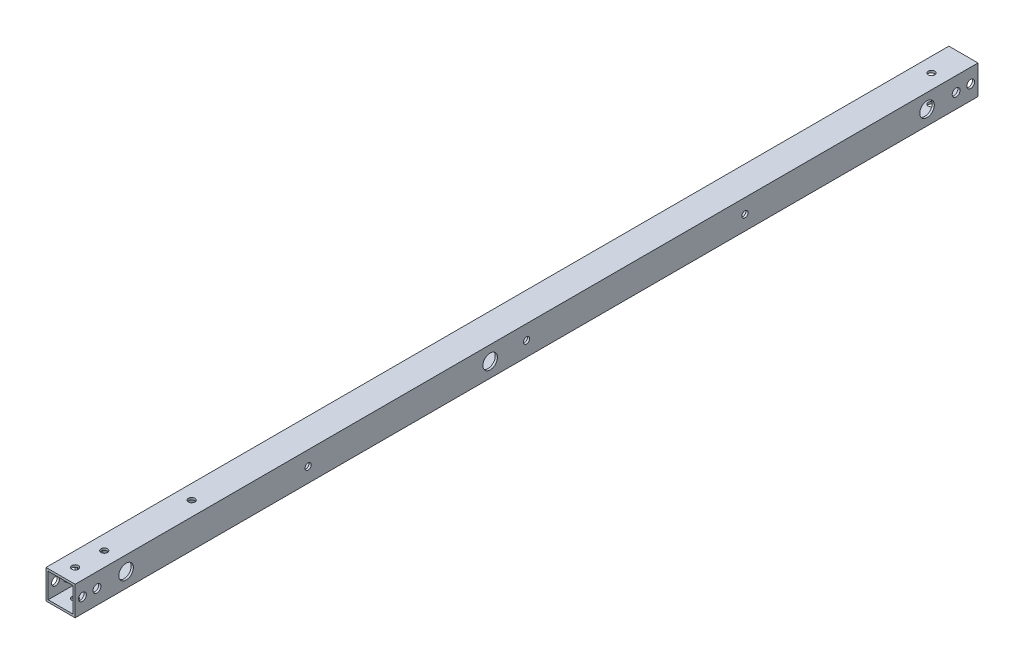
ISO-10303-21;
HEADER;
FILE_DESCRIPTION(('STEP AP214'),'2;1');
FILE_NAME('part.step','',(''),(''),'','','');
FILE_SCHEMA(('AUTOMOTIVE_DESIGN { 1 0 10303 214 1 1 1 1 }'));
ENDSEC;
DATA;
#1=APPLICATION_CONTEXT('core data for automotive mechanical design processes');
#2=APPLICATION_PROTOCOL_DEFINITION('international standard','automotive_design',2000,#1);
#3=PRODUCT_CONTEXT('',#1,'mechanical');
#4=PRODUCT('Part','Part','',(#3));
#5=PRODUCT_RELATED_PRODUCT_CATEGORY('part','',(#4));
#6=PRODUCT_DEFINITION_FORMATION('','',#4);
#7=PRODUCT_DEFINITION_CONTEXT('part definition',#1,'design');
#8=PRODUCT_DEFINITION('design','',#6,#7);
#9=PRODUCT_DEFINITION_SHAPE('','',#8);
#10=(LENGTH_UNIT() NAMED_UNIT(*) SI_UNIT(.MILLI.,.METRE.));
#11=(NAMED_UNIT(*) PLANE_ANGLE_UNIT() SI_UNIT($,.RADIAN.));
#12=(NAMED_UNIT(*) SI_UNIT($,.STERADIAN.) SOLID_ANGLE_UNIT());
#13=UNCERTAINTY_MEASURE_WITH_UNIT(LENGTH_MEASURE(1.E-05),#10,'distance_accuracy_value','');
#14=(GEOMETRIC_REPRESENTATION_CONTEXT(3) GLOBAL_UNCERTAINTY_ASSIGNED_CONTEXT((#13)) GLOBAL_UNIT_ASSIGNED_CONTEXT((#10,
#11,#12)) REPRESENTATION_CONTEXT('',''));
#15=CARTESIAN_POINT('',(0.,0.,0.));
#16=DIRECTION('',(0.,0.,1.));
#17=DIRECTION('',(1.,0.,0.));
#18=AXIS2_PLACEMENT_3D('',#15,#16,#17);
#19=CARTESIAN_POINT('',(-8.5,-8.5,620.));
#20=DIRECTION('',(1.,0.,0.));
#21=DIRECTION('',(0.,0.,-1.));
#22=AXIS2_PLACEMENT_3D('',#19,#20,#21);
#23=PLANE('',#22);
#24=CARTESIAN_POINT('',(-8.5,0.,160.));
#25=DIRECTION('',(-1.,0.,0.));
#26=DIRECTION('',(0.,0.,1.));
#27=AXIS2_PLACEMENT_3D('',#24,#25,#26);
#28=CIRCLE('',#27,5.);
#29=CARTESIAN_POINT('',(-8.5,0.,165.));
#30=VERTEX_POINT('',#29);
#31=EDGE_CURVE('E739',#30,#30,#28,.T.);
#32=ORIENTED_EDGE('',*,*,#31,.T.);
#33=EDGE_LOOP('',(#32));
#34=FACE_BOUND('',#33,.T.);
#35=CARTESIAN_POINT('',(-8.5,0.,310.));
#36=DIRECTION('',(-1.,0.,0.));
#37=DIRECTION('',(0.,0.,1.));
#38=AXIS2_PLACEMENT_3D('',#35,#36,#37);
#39=CIRCLE('',#38,5.);
#40=CARTESIAN_POINT('',(-8.5,0.,315.));
#41=VERTEX_POINT('',#40);
#42=EDGE_CURVE('E753',#41,#41,#39,.T.);
#43=ORIENTED_EDGE('',*,*,#42,.T.);
#44=EDGE_LOOP('',(#43));
#45=FACE_BOUND('',#44,.T.);
#46=DIRECTION('',(0.,-1.,0.));
#47=VECTOR('',#46,1.);
#48=CARTESIAN_POINT('',(-8.5,-8.5,0.));
#49=LINE('',#48,#47);
#50=CARTESIAN_POINT('',(-8.5,8.5,0.));
#51=VERTEX_POINT('',#50);
#52=CARTESIAN_POINT('',(-8.5,-8.5,0.));
#53=VERTEX_POINT('',#52);
#54=EDGE_CURVE('E160',#51,#53,#49,.T.);
#55=ORIENTED_EDGE('',*,*,#54,.F.);
#56=DIRECTION('',(0.,0.,-1.));
#57=VECTOR('',#56,1.);
#58=CARTESIAN_POINT('',(-8.5,8.5,620.));
#59=LINE('',#58,#57);
#60=CARTESIAN_POINT('',(-8.5,8.5,620.));
#61=VERTEX_POINT('',#60);
#62=EDGE_CURVE('E140',#61,#51,#59,.T.);
#63=ORIENTED_EDGE('',*,*,#62,.F.);
#64=DIRECTION('',(0.,-1.,0.));
#65=VECTOR('',#64,1.);
#66=CARTESIAN_POINT('',(-8.5,-8.5,620.));
#67=LINE('',#66,#65);
#68=CARTESIAN_POINT('',(-8.5,-8.5,620.));
#69=VERTEX_POINT('',#68);
#70=EDGE_CURVE('E144',#61,#69,#67,.T.);
#71=ORIENTED_EDGE('',*,*,#70,.T.);
#72=DIRECTION('',(0.,0.,-1.));
#73=VECTOR('',#72,1.);
#74=CARTESIAN_POINT('',(-8.5,-8.5,620.));
#75=LINE('',#74,#73);
#76=EDGE_CURVE('E71',#69,#53,#75,.T.);
#77=ORIENTED_EDGE('',*,*,#76,.T.);
#78=EDGE_LOOP('',(#55,#63,#71,#77));
#79=FACE_BOUND('',#78,.T.);
#80=CARTESIAN_POINT('',(-8.5,0.,335.));
#81=DIRECTION('',(1.,0.,0.));
#82=DIRECTION('',(0.,0.,-1.));
#83=AXIS2_PLACEMENT_3D('',#80,#81,#82);
#84=CIRCLE('',#83,2.69999999999996);
#85=CARTESIAN_POINT('',(-8.5,0.,332.3));
#86=VERTEX_POINT('',#85);
#87=EDGE_CURVE('E209',#86,#86,#84,.T.);
#88=ORIENTED_EDGE('',*,*,#87,.F.);
#89=EDGE_LOOP('',(#88));
#90=FACE_BOUND('',#89,.T.);
#91=CARTESIAN_POINT('',(-8.5,0.,34.9999999999999));
#92=DIRECTION('',(1.,0.,0.));
#93=DIRECTION('',(0.,0.,-1.));
#94=AXIS2_PLACEMENT_3D('',#91,#92,#93);
#95=CIRCLE('',#94,2.7);
#96=CARTESIAN_POINT('',(-8.5,0.,32.2999999999999));
#97=VERTEX_POINT('',#96);
#98=EDGE_CURVE('E215',#97,#97,#95,.T.);
#99=ORIENTED_EDGE('',*,*,#98,.F.);
#100=EDGE_LOOP('',(#99));
#101=FACE_BOUND('',#100,.T.);
#102=CARTESIAN_POINT('',(-8.5,0.,585.));
#103=DIRECTION('',(1.,0.,0.));
#104=DIRECTION('',(0.,0.,-1.));
#105=AXIS2_PLACEMENT_3D('',#102,#103,#104);
#106=CIRCLE('',#105,2.70000000000001);
#107=CARTESIAN_POINT('',(-8.5,0.,582.3));
#108=VERTEX_POINT('',#107);
#109=EDGE_CURVE('E220',#108,#108,#106,.T.);
#110=ORIENTED_EDGE('',*,*,#109,.F.);
#111=EDGE_LOOP('',(#110));
#112=FACE_BOUND('',#111,.T.);
#113=CARTESIAN_POINT('',(-8.5,0.,615.));
#114=DIRECTION('',(1.,0.,0.));
#115=DIRECTION('',(0.,0.,-1.));
#116=AXIS2_PLACEMENT_3D('',#113,#114,#115);
#117=CIRCLE('',#116,2.70000000000001);
#118=CARTESIAN_POINT('',(-8.5,0.,612.3));
#119=VERTEX_POINT('',#118);
#120=EDGE_CURVE('E242',#119,#119,#117,.T.);
#121=ORIENTED_EDGE('',*,*,#120,.F.);
#122=EDGE_LOOP('',(#121));
#123=FACE_BOUND('',#122,.T.);
#124=CARTESIAN_POINT('',(-8.5,0.,5.));
#125=DIRECTION('',(1.,0.,0.));
#126=DIRECTION('',(0.,0.,-1.));
#127=AXIS2_PLACEMENT_3D('',#124,#125,#126);
#128=CIRCLE('',#127,2.7);
#129=CARTESIAN_POINT('',(-8.5,0.,2.3));
#130=VERTEX_POINT('',#129);
#131=EDGE_CURVE('E248',#130,#130,#128,.T.);
#132=ORIENTED_EDGE('',*,*,#131,.F.);
#133=EDGE_LOOP('',(#132));
#134=FACE_BOUND('',#133,.T.);
#135=CARTESIAN_POINT('',(-8.5,0.,605.));
#136=DIRECTION('',(1.,0.,0.));
#137=DIRECTION('',(0.,0.,-1.));
#138=AXIS2_PLACEMENT_3D('',#135,#136,#137);
#139=CIRCLE('',#138,5.00000000000004);
#140=CARTESIAN_POINT('',(-8.5,0.,600.));
#141=VERTEX_POINT('',#140);
#142=EDGE_CURVE('E276',#141,#141,#139,.T.);
#143=ORIENTED_EDGE('',*,*,#142,.F.);
#144=EDGE_LOOP('',(#143));
#145=FACE_BOUND('',#144,.T.);
#146=CARTESIAN_POINT('',(-8.5,0.,15.));
#147=DIRECTION('',(1.,0.,0.));
#148=DIRECTION('',(0.,0.,-1.));
#149=AXIS2_PLACEMENT_3D('',#146,#147,#148);
#150=CIRCLE('',#149,5.);
#151=CARTESIAN_POINT('',(-8.5,0.,10.));
#152=VERTEX_POINT('',#151);
#153=EDGE_CURVE('E280',#152,#152,#150,.T.);
#154=ORIENTED_EDGE('',*,*,#153,.F.);
#155=EDGE_LOOP('',(#154));
#156=FACE_BOUND('',#155,.T.);
#157=CARTESIAN_POINT('',(-8.5,0.,460.));
#158=DIRECTION('',(-1.,0.,0.));
#159=DIRECTION('',(0.,0.,1.));
#160=AXIS2_PLACEMENT_3D('',#157,#158,#159);
#161=CIRCLE('',#160,5.);
#162=CARTESIAN_POINT('',(-8.5,0.,465.));
#163=VERTEX_POINT('',#162);
#164=EDGE_CURVE('E761',#163,#163,#161,.T.);
#165=ORIENTED_EDGE('',*,*,#164,.T.);
#166=EDGE_LOOP('',(#165));
#167=FACE_BOUND('',#166,.T.);
#168=ADVANCED_FACE('F53',(#34,#45,#79,#90,#101,#112,#123,#134,#145,#156,#167),#23,.T.);
#169=CARTESIAN_POINT('',(0.,0.,620.));
#170=DIRECTION('',(0.,0.,-1.));
#171=DIRECTION('',(-1.,0.,0.));
#172=AXIS2_PLACEMENT_3D('',#169,#170,#171);
#173=PLANE('',#172);
#174=DIRECTION('',(0.,1.,0.));
#175=VECTOR('',#174,1.);
#176=CARTESIAN_POINT('',(10.,-10.,620.));
#177=LINE('',#176,#175);
#178=CARTESIAN_POINT('',(10.,-10.,620.));
#179=VERTEX_POINT('',#178);
#180=CARTESIAN_POINT('',(10.,10.,620.));
#181=VERTEX_POINT('',#180);
#182=EDGE_CURVE('E173',#179,#181,#177,.T.);
#183=ORIENTED_EDGE('',*,*,#182,.T.);
#184=DIRECTION('',(-1.,0.,0.));
#185=VECTOR('',#184,1.);
#186=CARTESIAN_POINT('',(-10.,10.,620.));
#187=LINE('',#186,#185);
#188=CARTESIAN_POINT('',(-10.,10.,620.));
#189=VERTEX_POINT('',#188);
#190=EDGE_CURVE('E177',#181,#189,#187,.T.);
#191=ORIENTED_EDGE('',*,*,#190,.T.);
#192=DIRECTION('',(0.,-1.,0.));
#193=VECTOR('',#192,1.);
#194=CARTESIAN_POINT('',(-10.,-10.,620.));
#195=LINE('',#194,#193);
#196=CARTESIAN_POINT('',(-10.,-10.,620.));
#197=VERTEX_POINT('',#196);
#198=EDGE_CURVE('E181',#189,#197,#195,.T.);
#199=ORIENTED_EDGE('',*,*,#198,.T.);
#200=DIRECTION('',(1.,0.,0.));
#201=VECTOR('',#200,1.);
#202=CARTESIAN_POINT('',(-10.,-10.,620.));
#203=LINE('',#202,#201);
#204=EDGE_CURVE('E184',#197,#179,#203,.T.);
#205=ORIENTED_EDGE('',*,*,#204,.T.);
#206=EDGE_LOOP('',(#183,#191,#199,#205));
#207=FACE_BOUND('',#206,.T.);
#208=DIRECTION('',(0.,1.,0.));
#209=VECTOR('',#208,1.);
#210=CARTESIAN_POINT('',(8.5,-8.5,620.));
#211=LINE('',#210,#209);
#212=CARTESIAN_POINT('',(8.5,-8.5,620.));
#213=VERTEX_POINT('',#212);
#214=CARTESIAN_POINT('',(8.5,8.5,620.));
#215=VERTEX_POINT('',#214);
#216=EDGE_CURVE('E121',#213,#215,#211,.T.);
#217=ORIENTED_EDGE('',*,*,#216,.F.);
#218=DIRECTION('',(1.,0.,0.));
#219=VECTOR('',#218,1.);
#220=CARTESIAN_POINT('',(-8.5,-8.5,620.));
#221=LINE('',#220,#219);
#222=EDGE_CURVE('E149',#69,#213,#221,.T.);
#223=ORIENTED_EDGE('',*,*,#222,.F.);
#224=ORIENTED_EDGE('',*,*,#70,.F.);
#225=DIRECTION('',(-1.,0.,0.));
#226=VECTOR('',#225,1.);
#227=CARTESIAN_POINT('',(-8.5,8.5,620.));
#228=LINE('',#227,#226);
#229=EDGE_CURVE('E130',#215,#61,#228,.T.);
#230=ORIENTED_EDGE('',*,*,#229,.F.);
#231=EDGE_LOOP('',(#217,#223,#224,#230));
#232=FACE_BOUND('',#231,.T.);
#233=ADVANCED_FACE('F143',(#207,#232),#173,.F.);
#234=CARTESIAN_POINT('',(0.,0.,0.));
#235=DIRECTION('',(0.,0.,-1.));
#236=DIRECTION('',(-1.,0.,0.));
#237=AXIS2_PLACEMENT_3D('',#234,#235,#236);
#238=PLANE('',#237);
#239=DIRECTION('',(0.,1.,0.));
#240=VECTOR('',#239,1.);
#241=CARTESIAN_POINT('',(10.,-10.,0.));
#242=LINE('',#241,#240);
#243=CARTESIAN_POINT('',(10.,-10.,0.));
#244=VERTEX_POINT('',#243);
#245=CARTESIAN_POINT('',(10.,10.,0.));
#246=VERTEX_POINT('',#245);
#247=EDGE_CURVE('E139',#244,#246,#242,.T.);
#248=ORIENTED_EDGE('',*,*,#247,.F.);
#249=DIRECTION('',(1.,0.,0.));
#250=VECTOR('',#249,1.);
#251=CARTESIAN_POINT('',(-10.,-10.,0.));
#252=LINE('',#251,#250);
#253=CARTESIAN_POINT('',(-10.,-10.,0.));
#254=VERTEX_POINT('',#253);
#255=EDGE_CURVE('E178',#254,#244,#252,.T.);
#256=ORIENTED_EDGE('',*,*,#255,.F.);
#257=DIRECTION('',(0.,-1.,0.));
#258=VECTOR('',#257,1.);
#259=CARTESIAN_POINT('',(-10.,-10.,0.));
#260=LINE('',#259,#258);
#261=CARTESIAN_POINT('',(-10.,10.,0.));
#262=VERTEX_POINT('',#261);
#263=EDGE_CURVE('E194',#262,#254,#260,.T.);
#264=ORIENTED_EDGE('',*,*,#263,.F.);
#265=DIRECTION('',(-1.,0.,0.));
#266=VECTOR('',#265,1.);
#267=CARTESIAN_POINT('',(-10.,10.,0.));
#268=LINE('',#267,#266);
#269=EDGE_CURVE('E191',#246,#262,#268,.T.);
#270=ORIENTED_EDGE('',*,*,#269,.F.);
#271=EDGE_LOOP('',(#248,#256,#264,#270));
#272=FACE_BOUND('',#271,.T.);
#273=DIRECTION('',(1.,0.,0.));
#274=VECTOR('',#273,1.);
#275=CARTESIAN_POINT('',(-8.5,-8.5,0.));
#276=LINE('',#275,#274);
#277=CARTESIAN_POINT('',(8.5,-8.5,0.));
#278=VERTEX_POINT('',#277);
#279=EDGE_CURVE('E131',#53,#278,#276,.T.);
#280=ORIENTED_EDGE('',*,*,#279,.T.);
#281=DIRECTION('',(0.,1.,0.));
#282=VECTOR('',#281,1.);
#283=CARTESIAN_POINT('',(8.5,-8.5,0.));
#284=LINE('',#283,#282);
#285=CARTESIAN_POINT('',(8.5,8.5,0.));
#286=VERTEX_POINT('',#285);
#287=EDGE_CURVE('E79',#278,#286,#284,.T.);
#288=ORIENTED_EDGE('',*,*,#287,.T.);
#289=DIRECTION('',(-1.,0.,0.));
#290=VECTOR('',#289,1.);
#291=CARTESIAN_POINT('',(-8.5,8.5,0.));
#292=LINE('',#291,#290);
#293=EDGE_CURVE('E137',#286,#51,#292,.T.);
#294=ORIENTED_EDGE('',*,*,#293,.T.);
#295=ORIENTED_EDGE('',*,*,#54,.T.);
#296=EDGE_LOOP('',(#280,#288,#294,#295));
#297=FACE_BOUND('',#296,.T.);
#298=ADVANCED_FACE('F433',(#272,#297),#238,.T.);
#299=CARTESIAN_POINT('',(10.,-10.,620.));
#300=DIRECTION('',(-1.,0.,0.));
#301=DIRECTION('',(0.,0.,1.));
#302=AXIS2_PLACEMENT_3D('',#299,#300,#301);
#303=PLANE('',#302);
#304=CARTESIAN_POINT('',(10.,0.,460.));
#305=DIRECTION('',(1.,0.,0.));
#306=DIRECTION('',(0.,0.,-1.));
#307=AXIS2_PLACEMENT_3D('',#304,#305,#306);
#308=CIRCLE('',#307,2.14999999999999);
#309=CARTESIAN_POINT('',(10.,0.,457.85));
#310=VERTEX_POINT('',#309);
#311=EDGE_CURVE('E765',#310,#310,#308,.T.);
#312=ORIENTED_EDGE('',*,*,#311,.F.);
#313=EDGE_LOOP('',(#312));
#314=FACE_BOUND('',#313,.T.);
#315=CARTESIAN_POINT('',(10.,0.,310.));
#316=DIRECTION('',(1.,0.,0.));
#317=DIRECTION('',(0.,0.,-1.));
#318=AXIS2_PLACEMENT_3D('',#315,#316,#317);
#319=CIRCLE('',#318,2.14999999999999);
#320=CARTESIAN_POINT('',(10.,0.,307.85));
#321=VERTEX_POINT('',#320);
#322=EDGE_CURVE('E302',#321,#321,#319,.T.);
#323=ORIENTED_EDGE('',*,*,#322,.F.);
#324=EDGE_LOOP('',(#323));
#325=FACE_BOUND('',#324,.T.);
#326=CARTESIAN_POINT('',(10.,0.,160.));
#327=DIRECTION('',(1.,0.,0.));
#328=DIRECTION('',(0.,0.,-1.));
#329=AXIS2_PLACEMENT_3D('',#326,#327,#328);
#330=CIRCLE('',#329,2.14999999999999);
#331=CARTESIAN_POINT('',(10.,0.,157.85));
#332=VERTEX_POINT('',#331);
#333=EDGE_CURVE('E287',#332,#332,#330,.T.);
#334=ORIENTED_EDGE('',*,*,#333,.F.);
#335=EDGE_LOOP('',(#334));
#336=FACE_BOUND('',#335,.T.);
#337=CARTESIAN_POINT('',(10.,0.,585.));
#338=DIRECTION('',(-1.,0.,0.));
#339=DIRECTION('',(0.,0.,1.));
#340=AXIS2_PLACEMENT_3D('',#337,#338,#339);
#341=CIRCLE('',#340,5.00000000000004);
#342=CARTESIAN_POINT('',(10.,0.,590.));
#343=VERTEX_POINT('',#342);
#344=EDGE_CURVE('E275',#343,#343,#341,.F.);
#345=ORIENTED_EDGE('',*,*,#344,.F.);
#346=EDGE_LOOP('',(#345));
#347=FACE_BOUND('',#346,.T.);
#348=CARTESIAN_POINT('',(10.,0.,335.));
#349=DIRECTION('',(-1.,0.,0.));
#350=DIRECTION('',(0.,0.,1.));
#351=AXIS2_PLACEMENT_3D('',#348,#349,#350);
#352=CIRCLE('',#351,4.99999999999999);
#353=CARTESIAN_POINT('',(10.,0.,340.));
#354=VERTEX_POINT('',#353);
#355=EDGE_CURVE('E270',#354,#354,#352,.F.);
#356=ORIENTED_EDGE('',*,*,#355,.F.);
#357=EDGE_LOOP('',(#356));
#358=FACE_BOUND('',#357,.T.);
#359=CARTESIAN_POINT('',(10.,0.,34.9999999999999));
#360=DIRECTION('',(-1.,0.,0.));
#361=DIRECTION('',(0.,0.,1.));
#362=AXIS2_PLACEMENT_3D('',#359,#360,#361);
#363=CIRCLE('',#362,5.);
#364=CARTESIAN_POINT('',(10.,0.,39.9999999999999));
#365=VERTEX_POINT('',#364);
#366=EDGE_CURVE('E264',#365,#365,#363,.F.);
#367=ORIENTED_EDGE('',*,*,#366,.F.);
#368=EDGE_LOOP('',(#367));
#369=FACE_BOUND('',#368,.T.);
#370=CARTESIAN_POINT('',(10.,0.,5.));
#371=DIRECTION('',(1.,0.,0.));
#372=DIRECTION('',(0.,0.,-1.));
#373=AXIS2_PLACEMENT_3D('',#370,#371,#372);
#374=CIRCLE('',#373,2.7);
#375=CARTESIAN_POINT('',(10.,0.,2.3));
#376=VERTEX_POINT('',#375);
#377=EDGE_CURVE('E325',#376,#376,#374,.T.);
#378=ORIENTED_EDGE('',*,*,#377,.F.);
#379=EDGE_LOOP('',(#378));
#380=FACE_BOUND('',#379,.T.);
#381=CARTESIAN_POINT('',(10.,0.,615.));
#382=DIRECTION('',(1.,0.,0.));
#383=DIRECTION('',(0.,0.,-1.));
#384=AXIS2_PLACEMENT_3D('',#381,#382,#383);
#385=CIRCLE('',#384,2.70000000000001);
#386=CARTESIAN_POINT('',(10.,0.,612.3));
#387=VERTEX_POINT('',#386);
#388=EDGE_CURVE('E324',#387,#387,#385,.T.);
#389=ORIENTED_EDGE('',*,*,#388,.F.);
#390=EDGE_LOOP('',(#389));
#391=FACE_BOUND('',#390,.T.);
#392=CARTESIAN_POINT('',(10.,0.,605.));
#393=DIRECTION('',(1.,0.,0.));
#394=DIRECTION('',(0.,0.,-1.));
#395=AXIS2_PLACEMENT_3D('',#392,#393,#394);
#396=CIRCLE('',#395,2.70000000000001);
#397=CARTESIAN_POINT('',(10.,0.,602.3));
#398=VERTEX_POINT('',#397);
#399=EDGE_CURVE('E258',#398,#398,#396,.T.);
#400=ORIENTED_EDGE('',*,*,#399,.F.);
#401=EDGE_LOOP('',(#400));
#402=FACE_BOUND('',#401,.T.);
#403=CARTESIAN_POINT('',(10.,0.,15.));
#404=DIRECTION('',(1.,0.,0.));
#405=DIRECTION('',(0.,0.,-1.));
#406=AXIS2_PLACEMENT_3D('',#403,#404,#405);
#407=CIRCLE('',#406,2.7);
#408=CARTESIAN_POINT('',(10.,0.,12.3));
#409=VERTEX_POINT('',#408);
#410=EDGE_CURVE('E329',#409,#409,#407,.T.);
#411=ORIENTED_EDGE('',*,*,#410,.F.);
#412=EDGE_LOOP('',(#411));
#413=FACE_BOUND('',#412,.T.);
#414=ORIENTED_EDGE('',*,*,#247,.T.);
#415=DIRECTION('',(0.,0.,-1.));
#416=VECTOR('',#415,1.);
#417=CARTESIAN_POINT('',(10.,10.,620.));
#418=LINE('',#417,#416);
#419=EDGE_CURVE('E13',#181,#246,#418,.T.);
#420=ORIENTED_EDGE('',*,*,#419,.F.);
#421=ORIENTED_EDGE('',*,*,#182,.F.);
#422=DIRECTION('',(0.,0.,-1.));
#423=VECTOR('',#422,1.);
#424=CARTESIAN_POINT('',(10.,-10.,620.));
#425=LINE('',#424,#423);
#426=EDGE_CURVE('E187',#179,#244,#425,.T.);
#427=ORIENTED_EDGE('',*,*,#426,.T.);
#428=EDGE_LOOP('',(#414,#420,#421,#427));
#429=FACE_BOUND('',#428,.T.);
#430=ADVANCED_FACE('F55',(#314,#325,#336,#347,#358,#369,#380,#391,#402,#413,#429),#303,.F.);
#431=CARTESIAN_POINT('',(-10.,10.,620.));
#432=DIRECTION('',(0.,-1.,0.));
#433=DIRECTION('',(0.,0.,-1.));
#434=AXIS2_PLACEMENT_3D('',#431,#432,#433);
#435=PLANE('',#434);
#436=CARTESIAN_POINT('',(0.,10.,610.));
#437=DIRECTION('',(0.,1.,0.));
#438=DIRECTION('',(0.,0.,1.));
#439=AXIS2_PLACEMENT_3D('',#436,#437,#438);
#440=CIRCLE('',#439,2.24999999999998);
#441=CARTESIAN_POINT('',(0.,10.,612.25));
#442=VERTEX_POINT('',#441);
#443=EDGE_CURVE('E356',#442,#442,#440,.T.);
#444=ORIENTED_EDGE('',*,*,#443,.F.);
#445=EDGE_LOOP('',(#444));
#446=FACE_BOUND('',#445,.T.);
#447=CARTESIAN_POINT('',(0.,10.,590.));
#448=DIRECTION('',(0.,1.,0.));
#449=DIRECTION('',(0.,0.,1.));
#450=AXIS2_PLACEMENT_3D('',#447,#448,#449);
#451=CIRCLE('',#450,2.24999999999998);
#452=CARTESIAN_POINT('',(0.,10.,592.25));
#453=VERTEX_POINT('',#452);
#454=EDGE_CURVE('E362',#453,#453,#451,.T.);
#455=ORIENTED_EDGE('',*,*,#454,.F.);
#456=EDGE_LOOP('',(#455));
#457=FACE_BOUND('',#456,.T.);
#458=CARTESIAN_POINT('',(0.,10.,22.));
#459=DIRECTION('',(0.,1.,0.));
#460=DIRECTION('',(0.,0.,1.));
#461=AXIS2_PLACEMENT_3D('',#458,#459,#460);
#462=CIRCLE('',#461,2.25);
#463=CARTESIAN_POINT('',(0.,10.,24.25));
#464=VERTEX_POINT('',#463);
#465=EDGE_CURVE('E357',#464,#464,#462,.T.);
#466=ORIENTED_EDGE('',*,*,#465,.F.);
#467=EDGE_LOOP('',(#466));
#468=FACE_BOUND('',#467,.T.);
#469=CARTESIAN_POINT('',(-2.72685196434885E-13,10.,530.));
#470=DIRECTION('',(0.,1.,0.));
#471=DIRECTION('',(0.,0.,1.));
#472=AXIS2_PLACEMENT_3D('',#469,#470,#471);
#473=CIRCLE('',#472,2.24999999999998);
#474=CARTESIAN_POINT('',(-2.72685196434885E-13,10.,532.25));
#475=VERTEX_POINT('',#474);
#476=EDGE_CURVE('E361',#475,#475,#473,.T.);
#477=ORIENTED_EDGE('',*,*,#476,.F.);
#478=EDGE_LOOP('',(#477));
#479=FACE_BOUND('',#478,.T.);
#480=ORIENTED_EDGE('',*,*,#269,.T.);
#481=DIRECTION('',(0.,0.,-1.));
#482=VECTOR('',#481,1.);
#483=CARTESIAN_POINT('',(-10.,10.,620.));
#484=LINE('',#483,#482);
#485=EDGE_CURVE('E63',#189,#262,#484,.T.);
#486=ORIENTED_EDGE('',*,*,#485,.F.);
#487=ORIENTED_EDGE('',*,*,#190,.F.);
#488=ORIENTED_EDGE('',*,*,#419,.T.);
#489=EDGE_LOOP('',(#480,#486,#487,#488));
#490=FACE_BOUND('',#489,.T.);
#491=ADVANCED_FACE('F455',(#446,#457,#468,#479,#490),#435,.F.);
#492=CARTESIAN_POINT('',(-10.,-10.,620.));
#493=DIRECTION('',(1.,0.,0.));
#494=DIRECTION('',(0.,0.,-1.));
#495=AXIS2_PLACEMENT_3D('',#492,#493,#494);
#496=PLANE('',#495);
#497=CARTESIAN_POINT('',(-10.,0.,160.));
#498=DIRECTION('',(-1.,0.,0.));
#499=DIRECTION('',(0.,0.,1.));
#500=AXIS2_PLACEMENT_3D('',#497,#498,#499);
#501=CIRCLE('',#500,4.99999999999999);
#502=CARTESIAN_POINT('',(-10.,0.,165.));
#503=VERTEX_POINT('',#502);
#504=EDGE_CURVE('E742',#503,#503,#501,.T.);
#505=ORIENTED_EDGE('',*,*,#504,.F.);
#506=EDGE_LOOP('',(#505));
#507=FACE_BOUND('',#506,.T.);
#508=CARTESIAN_POINT('',(-10.,0.,310.));
#509=DIRECTION('',(-1.,0.,0.));
#510=DIRECTION('',(0.,0.,1.));
#511=AXIS2_PLACEMENT_3D('',#508,#509,#510);
#512=CIRCLE('',#511,4.99999999999999);
#513=CARTESIAN_POINT('',(-10.,0.,315.));
#514=VERTEX_POINT('',#513);
#515=EDGE_CURVE('E747',#514,#514,#512,.T.);
#516=ORIENTED_EDGE('',*,*,#515,.F.);
#517=EDGE_LOOP('',(#516));
#518=FACE_BOUND('',#517,.T.);
#519=CARTESIAN_POINT('',(-10.,0.,460.));
#520=DIRECTION('',(-1.,0.,0.));
#521=DIRECTION('',(0.,0.,1.));
#522=AXIS2_PLACEMENT_3D('',#519,#520,#521);
#523=CIRCLE('',#522,4.99999999999999);
#524=CARTESIAN_POINT('',(-10.,0.,465.));
#525=VERTEX_POINT('',#524);
#526=EDGE_CURVE('E757',#525,#525,#523,.T.);
#527=ORIENTED_EDGE('',*,*,#526,.F.);
#528=EDGE_LOOP('',(#527));
#529=FACE_BOUND('',#528,.T.);
#530=CARTESIAN_POINT('',(-10.,0.,15.));
#531=DIRECTION('',(-1.,0.,0.));
#532=DIRECTION('',(0.,0.,1.));
#533=AXIS2_PLACEMENT_3D('',#530,#531,#532);
#534=CIRCLE('',#533,5.);
#535=CARTESIAN_POINT('',(-10.,0.,20.));
#536=VERTEX_POINT('',#535);
#537=EDGE_CURVE('E283',#536,#536,#534,.T.);
#538=ORIENTED_EDGE('',*,*,#537,.F.);
#539=EDGE_LOOP('',(#538));
#540=FACE_BOUND('',#539,.T.);
#541=CARTESIAN_POINT('',(-10.,0.,605.));
#542=DIRECTION('',(1.,0.,0.));
#543=DIRECTION('',(0.,0.,-1.));
#544=AXIS2_PLACEMENT_3D('',#541,#542,#543);
#545=CIRCLE('',#544,5.00000000000004);
#546=CARTESIAN_POINT('',(-10.,0.,600.));
#547=VERTEX_POINT('',#546);
#548=EDGE_CURVE('E265',#547,#547,#545,.T.);
#549=ORIENTED_EDGE('',*,*,#548,.T.);
#550=EDGE_LOOP('',(#549));
#551=FACE_BOUND('',#550,.T.);
#552=CARTESIAN_POINT('',(-10.,0.,5.));
#553=DIRECTION('',(1.,0.,0.));
#554=DIRECTION('',(0.,0.,-1.));
#555=AXIS2_PLACEMENT_3D('',#552,#553,#554);
#556=CIRCLE('',#555,2.7);
#557=CARTESIAN_POINT('',(-10.,0.,2.3));
#558=VERTEX_POINT('',#557);
#559=EDGE_CURVE('E352',#558,#558,#556,.T.);
#560=ORIENTED_EDGE('',*,*,#559,.T.);
#561=EDGE_LOOP('',(#560));
#562=FACE_BOUND('',#561,.T.);
#563=CARTESIAN_POINT('',(-10.,0.,615.));
#564=DIRECTION('',(1.,0.,0.));
#565=DIRECTION('',(0.,0.,-1.));
#566=AXIS2_PLACEMENT_3D('',#563,#564,#565);
#567=CIRCLE('',#566,2.70000000000001);
#568=CARTESIAN_POINT('',(-10.,0.,612.3));
#569=VERTEX_POINT('',#568);
#570=EDGE_CURVE('E253',#569,#569,#567,.T.);
#571=ORIENTED_EDGE('',*,*,#570,.T.);
#572=EDGE_LOOP('',(#571));
#573=FACE_BOUND('',#572,.T.);
#574=CARTESIAN_POINT('',(-10.,0.,585.));
#575=DIRECTION('',(1.,0.,0.));
#576=DIRECTION('',(0.,0.,-1.));
#577=AXIS2_PLACEMENT_3D('',#574,#575,#576);
#578=CIRCLE('',#577,2.70000000000001);
#579=CARTESIAN_POINT('',(-10.,0.,582.3));
#580=VERTEX_POINT('',#579);
#581=EDGE_CURVE('E157',#580,#580,#578,.T.);
#582=ORIENTED_EDGE('',*,*,#581,.T.);
#583=EDGE_LOOP('',(#582));
#584=FACE_BOUND('',#583,.T.);
#585=CARTESIAN_POINT('',(-10.,0.,34.9999999999999));
#586=DIRECTION('',(1.,0.,0.));
#587=DIRECTION('',(0.,0.,-1.));
#588=AXIS2_PLACEMENT_3D('',#585,#586,#587);
#589=CIRCLE('',#588,2.7);
#590=CARTESIAN_POINT('',(-10.,0.,32.2999999999999));
#591=VERTEX_POINT('',#590);
#592=EDGE_CURVE('E219',#591,#591,#589,.T.);
#593=ORIENTED_EDGE('',*,*,#592,.T.);
#594=EDGE_LOOP('',(#593));
#595=FACE_BOUND('',#594,.T.);
#596=CARTESIAN_POINT('',(-10.,0.,335.));
#597=DIRECTION('',(1.,0.,0.));
#598=DIRECTION('',(0.,0.,-1.));
#599=AXIS2_PLACEMENT_3D('',#596,#597,#598);
#600=CIRCLE('',#599,2.69999999999996);
#601=CARTESIAN_POINT('',(-10.,0.,332.3));
#602=VERTEX_POINT('',#601);
#603=EDGE_CURVE('E213',#602,#602,#600,.T.);
#604=ORIENTED_EDGE('',*,*,#603,.T.);
#605=EDGE_LOOP('',(#604));
#606=FACE_BOUND('',#605,.T.);
#607=ORIENTED_EDGE('',*,*,#263,.T.);
#608=DIRECTION('',(0.,0.,-1.));
#609=VECTOR('',#608,1.);
#610=CARTESIAN_POINT('',(-10.,-10.,620.));
#611=LINE('',#610,#609);
#612=EDGE_CURVE('E202',#197,#254,#611,.T.);
#613=ORIENTED_EDGE('',*,*,#612,.F.);
#614=ORIENTED_EDGE('',*,*,#198,.F.);
#615=ORIENTED_EDGE('',*,*,#485,.T.);
#616=EDGE_LOOP('',(#607,#613,#614,#615));
#617=FACE_BOUND('',#616,.T.);
#618=ADVANCED_FACE('F403',(#507,#518,#529,#540,#551,#562,#573,#584,#595,#606,#617),#496,.F.);
#619=CARTESIAN_POINT('',(-10.,-10.,620.));
#620=DIRECTION('',(0.,1.,0.));
#621=DIRECTION('',(0.,0.,1.));
#622=AXIS2_PLACEMENT_3D('',#619,#620,#621);
#623=PLANE('',#622);
#624=CARTESIAN_POINT('',(-2.72685196434885E-13,-10.,530.));
#625=DIRECTION('',(0.,-1.,0.));
#626=DIRECTION('',(0.,0.,-1.));
#627=AXIS2_PLACEMENT_3D('',#624,#625,#626);
#628=CIRCLE('',#627,5.);
#629=CARTESIAN_POINT('',(-2.72685196434885E-13,-10.,525.));
#630=VERTEX_POINT('',#629);
#631=EDGE_CURVE('E259',#630,#630,#628,.T.);
#632=ORIENTED_EDGE('',*,*,#631,.F.);
#633=EDGE_LOOP('',(#632));
#634=FACE_BOUND('',#633,.T.);
#635=CARTESIAN_POINT('',(0.,-10.,610.));
#636=DIRECTION('',(0.,1.,0.));
#637=DIRECTION('',(0.,0.,1.));
#638=AXIS2_PLACEMENT_3D('',#635,#636,#637);
#639=CIRCLE('',#638,2.24999999999998);
#640=CARTESIAN_POINT('',(0.,-10.,612.25));
#641=VERTEX_POINT('',#640);
#642=EDGE_CURVE('E214',#641,#641,#639,.T.);
#643=ORIENTED_EDGE('',*,*,#642,.T.);
#644=EDGE_LOOP('',(#643));
#645=FACE_BOUND('',#644,.T.);
#646=CARTESIAN_POINT('',(0.,-10.,590.));
#647=DIRECTION('',(0.,1.,0.));
#648=DIRECTION('',(0.,0.,1.));
#649=AXIS2_PLACEMENT_3D('',#646,#647,#648);
#650=CIRCLE('',#649,2.24999999999998);
#651=CARTESIAN_POINT('',(0.,-10.,592.25));
#652=VERTEX_POINT('',#651);
#653=EDGE_CURVE('E241',#652,#652,#650,.T.);
#654=ORIENTED_EDGE('',*,*,#653,.T.);
#655=EDGE_LOOP('',(#654));
#656=FACE_BOUND('',#655,.T.);
#657=CARTESIAN_POINT('',(0.,-10.,22.));
#658=DIRECTION('',(0.,1.,0.));
#659=DIRECTION('',(0.,0.,1.));
#660=AXIS2_PLACEMENT_3D('',#657,#658,#659);
#661=CIRCLE('',#660,2.25);
#662=CARTESIAN_POINT('',(0.,-10.,24.25));
#663=VERTEX_POINT('',#662);
#664=EDGE_CURVE('E235',#663,#663,#661,.T.);
#665=ORIENTED_EDGE('',*,*,#664,.T.);
#666=EDGE_LOOP('',(#665));
#667=FACE_BOUND('',#666,.T.);
#668=ORIENTED_EDGE('',*,*,#255,.T.);
#669=ORIENTED_EDGE('',*,*,#426,.F.);
#670=ORIENTED_EDGE('',*,*,#204,.F.);
#671=ORIENTED_EDGE('',*,*,#612,.T.);
#672=EDGE_LOOP('',(#668,#669,#670,#671));
#673=FACE_BOUND('',#672,.T.);
#674=ADVANCED_FACE('F446',(#634,#645,#656,#667,#673),#623,.F.);
#675=CARTESIAN_POINT('',(8.5,-8.5,620.));
#676=DIRECTION('',(-1.,0.,0.));
#677=DIRECTION('',(0.,0.,1.));
#678=AXIS2_PLACEMENT_3D('',#675,#676,#677);
#679=PLANE('',#678);
#680=CARTESIAN_POINT('',(8.5,0.,460.));
#681=DIRECTION('',(-1.,0.,0.));
#682=DIRECTION('',(0.,0.,1.));
#683=AXIS2_PLACEMENT_3D('',#680,#681,#682);
#684=CIRCLE('',#683,2.14999999999999);
#685=CARTESIAN_POINT('',(8.5,0.,462.15));
#686=VERTEX_POINT('',#685);
#687=EDGE_CURVE('E768',#686,#686,#684,.T.);
#688=ORIENTED_EDGE('',*,*,#687,.F.);
#689=EDGE_LOOP('',(#688));
#690=FACE_BOUND('',#689,.T.);
#691=CARTESIAN_POINT('',(8.5,0.,310.));
#692=DIRECTION('',(-1.,0.,0.));
#693=DIRECTION('',(0.,0.,1.));
#694=AXIS2_PLACEMENT_3D('',#691,#692,#693);
#695=CIRCLE('',#694,2.14999999999999);
#696=CARTESIAN_POINT('',(8.5,0.,312.15));
#697=VERTEX_POINT('',#696);
#698=EDGE_CURVE('E57',#697,#697,#695,.T.);
#699=ORIENTED_EDGE('',*,*,#698,.F.);
#700=EDGE_LOOP('',(#699));
#701=FACE_BOUND('',#700,.T.);
#702=CARTESIAN_POINT('',(8.5,0.,160.));
#703=DIRECTION('',(-1.,0.,0.));
#704=DIRECTION('',(0.,0.,1.));
#705=AXIS2_PLACEMENT_3D('',#702,#703,#704);
#706=CIRCLE('',#705,2.14999999999999);
#707=CARTESIAN_POINT('',(8.5,0.,162.15));
#708=VERTEX_POINT('',#707);
#709=EDGE_CURVE('E284',#708,#708,#706,.T.);
#710=ORIENTED_EDGE('',*,*,#709,.F.);
#711=EDGE_LOOP('',(#710));
#712=FACE_BOUND('',#711,.T.);
#713=CARTESIAN_POINT('',(8.5,0.,585.));
#714=DIRECTION('',(-1.,0.,0.));
#715=DIRECTION('',(0.,0.,1.));
#716=AXIS2_PLACEMENT_3D('',#713,#714,#715);
#717=CIRCLE('',#716,5.00000000000004);
#718=CARTESIAN_POINT('',(8.5,0.,590.));
#719=VERTEX_POINT('',#718);
#720=EDGE_CURVE('E271',#719,#719,#717,.F.);
#721=ORIENTED_EDGE('',*,*,#720,.T.);
#722=EDGE_LOOP('',(#721));
#723=FACE_BOUND('',#722,.T.);
#724=CARTESIAN_POINT('',(8.5,0.,335.));
#725=DIRECTION('',(-1.,0.,0.));
#726=DIRECTION('',(0.,0.,1.));
#727=AXIS2_PLACEMENT_3D('',#724,#725,#726);
#728=CIRCLE('',#727,4.99999999999999);
#729=CARTESIAN_POINT('',(8.5,0.,340.));
#730=VERTEX_POINT('',#729);
#731=EDGE_CURVE('E266',#730,#730,#728,.F.);
#732=ORIENTED_EDGE('',*,*,#731,.T.);
#733=EDGE_LOOP('',(#732));
#734=FACE_BOUND('',#733,.T.);
#735=CARTESIAN_POINT('',(8.5,0.,34.9999999999999));
#736=DIRECTION('',(-1.,0.,0.));
#737=DIRECTION('',(0.,0.,1.));
#738=AXIS2_PLACEMENT_3D('',#735,#736,#737);
#739=CIRCLE('',#738,5.);
#740=CARTESIAN_POINT('',(8.5,0.,39.9999999999999));
#741=VERTEX_POINT('',#740);
#742=EDGE_CURVE('E260',#741,#741,#739,.F.);
#743=ORIENTED_EDGE('',*,*,#742,.T.);
#744=EDGE_LOOP('',(#743));
#745=FACE_BOUND('',#744,.T.);
#746=CARTESIAN_POINT('',(8.5,0.,5.));
#747=DIRECTION('',(-1.,0.,0.));
#748=DIRECTION('',(0.,0.,1.));
#749=AXIS2_PLACEMENT_3D('',#746,#747,#748);
#750=CIRCLE('',#749,2.7);
#751=CARTESIAN_POINT('',(8.5,0.,7.7));
#752=VERTEX_POINT('',#751);
#753=EDGE_CURVE('E252',#752,#752,#750,.T.);
#754=ORIENTED_EDGE('',*,*,#753,.F.);
#755=EDGE_LOOP('',(#754));
#756=FACE_BOUND('',#755,.T.);
#757=CARTESIAN_POINT('',(8.5,0.,615.));
#758=DIRECTION('',(-1.,0.,0.));
#759=DIRECTION('',(0.,0.,1.));
#760=AXIS2_PLACEMENT_3D('',#757,#758,#759);
#761=CIRCLE('',#760,2.70000000000001);
#762=CARTESIAN_POINT('',(8.5,0.,617.7));
#763=VERTEX_POINT('',#762);
#764=EDGE_CURVE('E246',#763,#763,#761,.T.);
#765=ORIENTED_EDGE('',*,*,#764,.F.);
#766=EDGE_LOOP('',(#765));
#767=FACE_BOUND('',#766,.T.);
#768=CARTESIAN_POINT('',(8.5,0.,605.));
#769=DIRECTION('',(-1.,0.,0.));
#770=DIRECTION('',(0.,0.,1.));
#771=AXIS2_PLACEMENT_3D('',#768,#769,#770);
#772=CIRCLE('',#771,2.70000000000001);
#773=CARTESIAN_POINT('',(8.5,0.,607.7));
#774=VERTEX_POINT('',#773);
#775=EDGE_CURVE('E247',#774,#774,#772,.T.);
#776=ORIENTED_EDGE('',*,*,#775,.F.);
#777=EDGE_LOOP('',(#776));
#778=FACE_BOUND('',#777,.T.);
#779=CARTESIAN_POINT('',(8.5,0.,15.));
#780=DIRECTION('',(-1.,0.,0.));
#781=DIRECTION('',(0.,0.,1.));
#782=AXIS2_PLACEMENT_3D('',#779,#780,#781);
#783=CIRCLE('',#782,2.7);
#784=CARTESIAN_POINT('',(8.5,0.,17.7));
#785=VERTEX_POINT('',#784);
#786=EDGE_CURVE('E336',#785,#785,#783,.T.);
#787=ORIENTED_EDGE('',*,*,#786,.F.);
#788=EDGE_LOOP('',(#787));
#789=FACE_BOUND('',#788,.T.);
#790=ORIENTED_EDGE('',*,*,#287,.F.);
#791=DIRECTION('',(0.,0.,-1.));
#792=VECTOR('',#791,1.);
#793=CARTESIAN_POINT('',(8.5,-8.5,620.));
#794=LINE('',#793,#792);
#795=EDGE_CURVE('E125',#213,#278,#794,.T.);
#796=ORIENTED_EDGE('',*,*,#795,.F.);
#797=ORIENTED_EDGE('',*,*,#216,.T.);
#798=DIRECTION('',(0.,0.,-1.));
#799=VECTOR('',#798,1.);
#800=CARTESIAN_POINT('',(8.5,8.5,620.));
#801=LINE('',#800,#799);
#802=EDGE_CURVE('E124',#215,#286,#801,.T.);
#803=ORIENTED_EDGE('',*,*,#802,.T.);
#804=EDGE_LOOP('',(#790,#796,#797,#803));
#805=FACE_BOUND('',#804,.T.);
#806=ADVANCED_FACE('F123',(#690,#701,#712,#723,#734,#745,#756,#767,#778,#789,#805),#679,.T.);
#807=CARTESIAN_POINT('',(-8.5,8.5,620.));
#808=DIRECTION('',(0.,-1.,0.));
#809=DIRECTION('',(0.,0.,-1.));
#810=AXIS2_PLACEMENT_3D('',#807,#808,#809);
#811=PLANE('',#810);
#812=CARTESIAN_POINT('',(0.,8.5,610.));
#813=DIRECTION('',(0.,-1.,0.));
#814=DIRECTION('',(0.,0.,-1.));
#815=AXIS2_PLACEMENT_3D('',#812,#813,#814);
#816=CIRCLE('',#815,2.24999999999998);
#817=CARTESIAN_POINT('',(0.,8.5,607.75));
#818=VERTEX_POINT('',#817);
#819=EDGE_CURVE('E240',#818,#818,#816,.T.);
#820=ORIENTED_EDGE('',*,*,#819,.F.);
#821=EDGE_LOOP('',(#820));
#822=FACE_BOUND('',#821,.T.);
#823=CARTESIAN_POINT('',(0.,8.5,590.));
#824=DIRECTION('',(0.,-1.,0.));
#825=DIRECTION('',(0.,0.,-1.));
#826=AXIS2_PLACEMENT_3D('',#823,#824,#825);
#827=CIRCLE('',#826,2.24999999999998);
#828=CARTESIAN_POINT('',(0.,8.5,587.75));
#829=VERTEX_POINT('',#828);
#830=EDGE_CURVE('E234',#829,#829,#827,.T.);
#831=ORIENTED_EDGE('',*,*,#830,.F.);
#832=EDGE_LOOP('',(#831));
#833=FACE_BOUND('',#832,.T.);
#834=CARTESIAN_POINT('',(0.,8.5,22.));
#835=DIRECTION('',(0.,-1.,0.));
#836=DIRECTION('',(0.,0.,-1.));
#837=AXIS2_PLACEMENT_3D('',#834,#835,#836);
#838=CIRCLE('',#837,2.25);
#839=CARTESIAN_POINT('',(0.,8.5,19.75));
#840=VERTEX_POINT('',#839);
#841=EDGE_CURVE('E228',#840,#840,#838,.T.);
#842=ORIENTED_EDGE('',*,*,#841,.F.);
#843=EDGE_LOOP('',(#842));
#844=FACE_BOUND('',#843,.T.);
#845=CARTESIAN_POINT('',(-2.72685196434885E-13,8.5,530.));
#846=DIRECTION('',(0.,-1.,0.));
#847=DIRECTION('',(0.,0.,-1.));
#848=AXIS2_PLACEMENT_3D('',#845,#846,#847);
#849=CIRCLE('',#848,2.24999999999998);
#850=CARTESIAN_POINT('',(-2.72685196434885E-13,8.5,527.75));
#851=VERTEX_POINT('',#850);
#852=EDGE_CURVE('E229',#851,#851,#849,.T.);
#853=ORIENTED_EDGE('',*,*,#852,.F.);
#854=EDGE_LOOP('',(#853));
#855=FACE_BOUND('',#854,.T.);
#856=ORIENTED_EDGE('',*,*,#293,.F.);
#857=ORIENTED_EDGE('',*,*,#802,.F.);
#858=ORIENTED_EDGE('',*,*,#229,.T.);
#859=ORIENTED_EDGE('',*,*,#62,.T.);
#860=EDGE_LOOP('',(#856,#857,#858,#859));
#861=FACE_BOUND('',#860,.T.);
#862=ADVANCED_FACE('F134',(#822,#833,#844,#855,#861),#811,.T.);
#863=CARTESIAN_POINT('',(-8.5,-8.5,620.));
#864=DIRECTION('',(0.,1.,0.));
#865=DIRECTION('',(0.,0.,1.));
#866=AXIS2_PLACEMENT_3D('',#863,#864,#865);
#867=PLANE('',#866);
#868=CARTESIAN_POINT('',(-2.72685196434885E-13,-8.5,530.));
#869=DIRECTION('',(0.,1.,0.));
#870=DIRECTION('',(0.,0.,1.));
#871=AXIS2_PLACEMENT_3D('',#868,#869,#870);
#872=CIRCLE('',#871,5.);
#873=CARTESIAN_POINT('',(-2.72685196434885E-13,-8.5,535.));
#874=VERTEX_POINT('',#873);
#875=EDGE_CURVE('E254',#874,#874,#872,.T.);
#876=ORIENTED_EDGE('',*,*,#875,.F.);
#877=EDGE_LOOP('',(#876));
#878=FACE_BOUND('',#877,.T.);
#879=CARTESIAN_POINT('',(0.,-8.5,610.));
#880=DIRECTION('',(0.,1.,0.));
#881=DIRECTION('',(0.,0.,1.));
#882=AXIS2_PLACEMENT_3D('',#879,#880,#881);
#883=CIRCLE('',#882,2.24999999999998);
#884=CARTESIAN_POINT('',(0.,-8.5,612.25));
#885=VERTEX_POINT('',#884);
#886=EDGE_CURVE('E236',#885,#885,#883,.T.);
#887=ORIENTED_EDGE('',*,*,#886,.F.);
#888=EDGE_LOOP('',(#887));
#889=FACE_BOUND('',#888,.T.);
#890=CARTESIAN_POINT('',(0.,-8.5,590.));
#891=DIRECTION('',(0.,1.,0.));
#892=DIRECTION('',(0.,0.,1.));
#893=AXIS2_PLACEMENT_3D('',#890,#891,#892);
#894=CIRCLE('',#893,2.24999999999998);
#895=CARTESIAN_POINT('',(0.,-8.5,592.25));
#896=VERTEX_POINT('',#895);
#897=EDGE_CURVE('E230',#896,#896,#894,.T.);
#898=ORIENTED_EDGE('',*,*,#897,.F.);
#899=EDGE_LOOP('',(#898));
#900=FACE_BOUND('',#899,.T.);
#901=CARTESIAN_POINT('',(0.,-8.5,22.));
#902=DIRECTION('',(0.,1.,0.));
#903=DIRECTION('',(0.,0.,1.));
#904=AXIS2_PLACEMENT_3D('',#901,#902,#903);
#905=CIRCLE('',#904,2.25);
#906=CARTESIAN_POINT('',(0.,-8.5,24.25));
#907=VERTEX_POINT('',#906);
#908=EDGE_CURVE('E224',#907,#907,#905,.T.);
#909=ORIENTED_EDGE('',*,*,#908,.F.);
#910=EDGE_LOOP('',(#909));
#911=FACE_BOUND('',#910,.T.);
#912=ORIENTED_EDGE('',*,*,#279,.F.);
#913=ORIENTED_EDGE('',*,*,#76,.F.);
#914=ORIENTED_EDGE('',*,*,#222,.T.);
#915=ORIENTED_EDGE('',*,*,#795,.T.);
#916=EDGE_LOOP('',(#912,#913,#914,#915));
#917=FACE_BOUND('',#916,.T.);
#918=ADVANCED_FACE('F440',(#878,#889,#900,#911,#917),#867,.T.);
#919=CARTESIAN_POINT('',(-15.,0.,335.));
#920=DIRECTION('',(1.,0.,0.));
#921=DIRECTION('',(0.,0.,-1.));
#922=AXIS2_PLACEMENT_3D('',#919,#920,#921);
#923=CYLINDRICAL_SURFACE('',#922,2.69999999999996);
#924=ORIENTED_EDGE('',*,*,#87,.T.);
#925=EDGE_LOOP('',(#924));
#926=FACE_BOUND('',#925,.T.);
#927=ORIENTED_EDGE('',*,*,#603,.F.);
#928=EDGE_LOOP('',(#927));
#929=FACE_BOUND('',#928,.T.);
#930=ADVANCED_FACE('F421',(#926,#929),#923,.F.);
#931=CARTESIAN_POINT('',(-15.,0.,34.9999999999999));
#932=DIRECTION('',(1.,0.,0.));
#933=DIRECTION('',(0.,0.,-1.));
#934=AXIS2_PLACEMENT_3D('',#931,#932,#933);
#935=CYLINDRICAL_SURFACE('',#934,2.7);
#936=ORIENTED_EDGE('',*,*,#98,.T.);
#937=EDGE_LOOP('',(#936));
#938=FACE_BOUND('',#937,.T.);
#939=ORIENTED_EDGE('',*,*,#592,.F.);
#940=EDGE_LOOP('',(#939));
#941=FACE_BOUND('',#940,.T.);
#942=ADVANCED_FACE('F409',(#938,#941),#935,.F.);
#943=CARTESIAN_POINT('',(-15.,0.,585.));
#944=DIRECTION('',(1.,0.,0.));
#945=DIRECTION('',(0.,0.,-1.));
#946=AXIS2_PLACEMENT_3D('',#943,#944,#945);
#947=CYLINDRICAL_SURFACE('',#946,2.70000000000001);
#948=ORIENTED_EDGE('',*,*,#109,.T.);
#949=EDGE_LOOP('',(#948));
#950=FACE_BOUND('',#949,.T.);
#951=ORIENTED_EDGE('',*,*,#581,.F.);
#952=EDGE_LOOP('',(#951));
#953=FACE_BOUND('',#952,.T.);
#954=ADVANCED_FACE('F406',(#950,#953),#947,.F.);
#955=CARTESIAN_POINT('',(0.,-15.,22.));
#956=DIRECTION('',(0.,1.,0.));
#957=DIRECTION('',(0.,0.,1.));
#958=AXIS2_PLACEMENT_3D('',#955,#956,#957);
#959=CYLINDRICAL_SURFACE('',#958,2.25);
#960=ORIENTED_EDGE('',*,*,#908,.T.);
#961=EDGE_LOOP('',(#960));
#962=FACE_BOUND('',#961,.T.);
#963=ORIENTED_EDGE('',*,*,#664,.F.);
#964=EDGE_LOOP('',(#963));
#965=FACE_BOUND('',#964,.T.);
#966=ADVANCED_FACE('F408',(#962,#965),#959,.F.);
#967=CARTESIAN_POINT('',(0.,-15.,590.));
#968=DIRECTION('',(0.,1.,0.));
#969=DIRECTION('',(0.,0.,1.));
#970=AXIS2_PLACEMENT_3D('',#967,#968,#969);
#971=CYLINDRICAL_SURFACE('',#970,2.24999999999998);
#972=ORIENTED_EDGE('',*,*,#897,.T.);
#973=EDGE_LOOP('',(#972));
#974=FACE_BOUND('',#973,.T.);
#975=ORIENTED_EDGE('',*,*,#653,.F.);
#976=EDGE_LOOP('',(#975));
#977=FACE_BOUND('',#976,.T.);
#978=ADVANCED_FACE('F417',(#974,#977),#971,.F.);
#979=CARTESIAN_POINT('',(0.,-15.,610.));
#980=DIRECTION('',(0.,1.,0.));
#981=DIRECTION('',(0.,0.,1.));
#982=AXIS2_PLACEMENT_3D('',#979,#980,#981);
#983=CYLINDRICAL_SURFACE('',#982,2.24999999999998);
#984=ORIENTED_EDGE('',*,*,#886,.T.);
#985=EDGE_LOOP('',(#984));
#986=FACE_BOUND('',#985,.T.);
#987=ORIENTED_EDGE('',*,*,#642,.F.);
#988=EDGE_LOOP('',(#987));
#989=FACE_BOUND('',#988,.T.);
#990=ADVANCED_FACE('F505',(#986,#989),#983,.F.);
#991=CARTESIAN_POINT('',(-2.72685196434885E-13,-15.,530.));
#992=DIRECTION('',(0.,1.,0.));
#993=DIRECTION('',(0.,0.,1.));
#994=AXIS2_PLACEMENT_3D('',#991,#992,#993);
#995=CYLINDRICAL_SURFACE('',#994,2.24999999999998);
#996=ORIENTED_EDGE('',*,*,#852,.T.);
#997=EDGE_LOOP('',(#996));
#998=FACE_BOUND('',#997,.T.);
#999=ORIENTED_EDGE('',*,*,#476,.T.);
#1000=EDGE_LOOP('',(#999));
#1001=FACE_BOUND('',#1000,.T.);
#1002=ADVANCED_FACE('F513',(#998,#1001),#995,.F.);
#1003=ORIENTED_EDGE('',*,*,#841,.T.);
#1004=EDGE_LOOP('',(#1003));
#1005=FACE_BOUND('',#1004,.T.);
#1006=ORIENTED_EDGE('',*,*,#465,.T.);
#1007=EDGE_LOOP('',(#1006));
#1008=FACE_BOUND('',#1007,.T.);
#1009=ADVANCED_FACE('F420',(#1005,#1008),#959,.F.);
#1010=ORIENTED_EDGE('',*,*,#830,.T.);
#1011=EDGE_LOOP('',(#1010));
#1012=FACE_BOUND('',#1011,.T.);
#1013=ORIENTED_EDGE('',*,*,#454,.T.);
#1014=EDGE_LOOP('',(#1013));
#1015=FACE_BOUND('',#1014,.T.);
#1016=ADVANCED_FACE('F507',(#1012,#1015),#971,.F.);
#1017=ORIENTED_EDGE('',*,*,#819,.T.);
#1018=EDGE_LOOP('',(#1017));
#1019=FACE_BOUND('',#1018,.T.);
#1020=ORIENTED_EDGE('',*,*,#443,.T.);
#1021=EDGE_LOOP('',(#1020));
#1022=FACE_BOUND('',#1021,.T.);
#1023=ADVANCED_FACE('F516',(#1019,#1022),#983,.F.);
#1024=CARTESIAN_POINT('',(-30.,0.,615.));
#1025=DIRECTION('',(1.,0.,0.));
#1026=DIRECTION('',(0.,0.,-1.));
#1027=AXIS2_PLACEMENT_3D('',#1024,#1025,#1026);
#1028=CYLINDRICAL_SURFACE('',#1027,2.70000000000001);
#1029=ORIENTED_EDGE('',*,*,#120,.T.);
#1030=EDGE_LOOP('',(#1029));
#1031=FACE_BOUND('',#1030,.T.);
#1032=ORIENTED_EDGE('',*,*,#570,.F.);
#1033=EDGE_LOOP('',(#1032));
#1034=FACE_BOUND('',#1033,.T.);
#1035=ADVANCED_FACE('F523',(#1031,#1034),#1028,.F.);
#1036=CARTESIAN_POINT('',(-30.,0.,5.));
#1037=DIRECTION('',(1.,0.,0.));
#1038=DIRECTION('',(0.,0.,-1.));
#1039=AXIS2_PLACEMENT_3D('',#1036,#1037,#1038);
#1040=CYLINDRICAL_SURFACE('',#1039,2.7);
#1041=ORIENTED_EDGE('',*,*,#131,.T.);
#1042=EDGE_LOOP('',(#1041));
#1043=FACE_BOUND('',#1042,.T.);
#1044=ORIENTED_EDGE('',*,*,#559,.F.);
#1045=EDGE_LOOP('',(#1044));
#1046=FACE_BOUND('',#1045,.T.);
#1047=ADVANCED_FACE('F565',(#1043,#1046),#1040,.F.);
#1048=CARTESIAN_POINT('',(-30.,0.,15.));
#1049=DIRECTION('',(1.,0.,0.));
#1050=DIRECTION('',(0.,0.,-1.));
#1051=AXIS2_PLACEMENT_3D('',#1048,#1049,#1050);
#1052=CYLINDRICAL_SURFACE('',#1051,2.7);
#1053=ORIENTED_EDGE('',*,*,#786,.T.);
#1054=EDGE_LOOP('',(#1053));
#1055=FACE_BOUND('',#1054,.T.);
#1056=ORIENTED_EDGE('',*,*,#410,.T.);
#1057=EDGE_LOOP('',(#1056));
#1058=FACE_BOUND('',#1057,.T.);
#1059=ADVANCED_FACE('F576',(#1055,#1058),#1052,.F.);
#1060=CARTESIAN_POINT('',(-30.,0.,605.));
#1061=DIRECTION('',(1.,0.,0.));
#1062=DIRECTION('',(0.,0.,-1.));
#1063=AXIS2_PLACEMENT_3D('',#1060,#1061,#1062);
#1064=CYLINDRICAL_SURFACE('',#1063,2.70000000000001);
#1065=ORIENTED_EDGE('',*,*,#775,.T.);
#1066=EDGE_LOOP('',(#1065));
#1067=FACE_BOUND('',#1066,.T.);
#1068=ORIENTED_EDGE('',*,*,#399,.T.);
#1069=EDGE_LOOP('',(#1068));
#1070=FACE_BOUND('',#1069,.T.);
#1071=ADVANCED_FACE('F587',(#1067,#1070),#1064,.F.);
#1072=ORIENTED_EDGE('',*,*,#764,.T.);
#1073=EDGE_LOOP('',(#1072));
#1074=FACE_BOUND('',#1073,.T.);
#1075=ORIENTED_EDGE('',*,*,#388,.T.);
#1076=EDGE_LOOP('',(#1075));
#1077=FACE_BOUND('',#1076,.T.);
#1078=ADVANCED_FACE('F568',(#1074,#1077),#1028,.F.);
#1079=ORIENTED_EDGE('',*,*,#753,.T.);
#1080=EDGE_LOOP('',(#1079));
#1081=FACE_BOUND('',#1080,.T.);
#1082=ORIENTED_EDGE('',*,*,#377,.T.);
#1083=EDGE_LOOP('',(#1082));
#1084=FACE_BOUND('',#1083,.T.);
#1085=ADVANCED_FACE('F579',(#1081,#1084),#1040,.F.);
#1086=CARTESIAN_POINT('',(-2.72685196434885E-13,0.,530.));
#1087=DIRECTION('',(0.,-1.,0.));
#1088=DIRECTION('',(0.,0.,-1.));
#1089=AXIS2_PLACEMENT_3D('',#1086,#1087,#1088);
#1090=CYLINDRICAL_SURFACE('',#1089,5.);
#1091=ORIENTED_EDGE('',*,*,#875,.T.);
#1092=EDGE_LOOP('',(#1091));
#1093=FACE_BOUND('',#1092,.T.);
#1094=ORIENTED_EDGE('',*,*,#631,.T.);
#1095=EDGE_LOOP('',(#1094));
#1096=FACE_BOUND('',#1095,.T.);
#1097=ADVANCED_FACE('F614',(#1093,#1096),#1090,.F.);
#1098=CARTESIAN_POINT('',(20.,0.,34.9999999999999));
#1099=DIRECTION('',(-1.,0.,0.));
#1100=DIRECTION('',(0.,0.,1.));
#1101=AXIS2_PLACEMENT_3D('',#1098,#1099,#1100);
#1102=CYLINDRICAL_SURFACE('',#1101,5.);
#1103=ORIENTED_EDGE('',*,*,#742,.F.);
#1104=EDGE_LOOP('',(#1103));
#1105=FACE_BOUND('',#1104,.T.);
#1106=ORIENTED_EDGE('',*,*,#366,.T.);
#1107=EDGE_LOOP('',(#1106));
#1108=FACE_BOUND('',#1107,.T.);
#1109=ADVANCED_FACE('F622',(#1105,#1108),#1102,.F.);
#1110=CARTESIAN_POINT('',(20.,0.,335.));
#1111=DIRECTION('',(-1.,0.,0.));
#1112=DIRECTION('',(0.,0.,1.));
#1113=AXIS2_PLACEMENT_3D('',#1110,#1111,#1112);
#1114=CYLINDRICAL_SURFACE('',#1113,4.99999999999999);
#1115=ORIENTED_EDGE('',*,*,#731,.F.);
#1116=EDGE_LOOP('',(#1115));
#1117=FACE_BOUND('',#1116,.T.);
#1118=ORIENTED_EDGE('',*,*,#355,.T.);
#1119=EDGE_LOOP('',(#1118));
#1120=FACE_BOUND('',#1119,.T.);
#1121=ADVANCED_FACE('F632',(#1117,#1120),#1114,.F.);
#1122=CARTESIAN_POINT('',(20.,0.,585.));
#1123=DIRECTION('',(-1.,0.,0.));
#1124=DIRECTION('',(0.,0.,1.));
#1125=AXIS2_PLACEMENT_3D('',#1122,#1123,#1124);
#1126=CYLINDRICAL_SURFACE('',#1125,5.00000000000004);
#1127=ORIENTED_EDGE('',*,*,#720,.F.);
#1128=EDGE_LOOP('',(#1127));
#1129=FACE_BOUND('',#1128,.T.);
#1130=ORIENTED_EDGE('',*,*,#344,.T.);
#1131=EDGE_LOOP('',(#1130));
#1132=FACE_BOUND('',#1131,.T.);
#1133=ADVANCED_FACE('F642',(#1129,#1132),#1126,.F.);
#1134=CARTESIAN_POINT('',(-30.,0.,605.));
#1135=DIRECTION('',(1.,0.,0.));
#1136=DIRECTION('',(0.,0.,-1.));
#1137=AXIS2_PLACEMENT_3D('',#1134,#1135,#1136);
#1138=CYLINDRICAL_SURFACE('',#1137,5.00000000000004);
#1139=ORIENTED_EDGE('',*,*,#142,.T.);
#1140=EDGE_LOOP('',(#1139));
#1141=FACE_BOUND('',#1140,.T.);
#1142=ORIENTED_EDGE('',*,*,#548,.F.);
#1143=EDGE_LOOP('',(#1142));
#1144=FACE_BOUND('',#1143,.T.);
#1145=ADVANCED_FACE('F652',(#1141,#1144),#1138,.F.);
#1146=CARTESIAN_POINT('',(-5.,0.,15.));
#1147=DIRECTION('',(-1.,0.,0.));
#1148=DIRECTION('',(0.,0.,1.));
#1149=AXIS2_PLACEMENT_3D('',#1146,#1147,#1148);
#1150=CYLINDRICAL_SURFACE('',#1149,5.);
#1151=ORIENTED_EDGE('',*,*,#153,.T.);
#1152=EDGE_LOOP('',(#1151));
#1153=FACE_BOUND('',#1152,.T.);
#1154=ORIENTED_EDGE('',*,*,#537,.T.);
#1155=EDGE_LOOP('',(#1154));
#1156=FACE_BOUND('',#1155,.T.);
#1157=ADVANCED_FACE('F662',(#1153,#1156),#1150,.F.);
#1158=CARTESIAN_POINT('',(10.,0.,160.));
#1159=DIRECTION('',(1.,0.,0.));
#1160=DIRECTION('',(0.,0.,-1.));
#1161=AXIS2_PLACEMENT_3D('',#1158,#1159,#1160);
#1162=CYLINDRICAL_SURFACE('',#1161,2.14999999999999);
#1163=ORIENTED_EDGE('',*,*,#709,.T.);
#1164=EDGE_LOOP('',(#1163));
#1165=FACE_BOUND('',#1164,.T.);
#1166=ORIENTED_EDGE('',*,*,#333,.T.);
#1167=EDGE_LOOP('',(#1166));
#1168=FACE_BOUND('',#1167,.T.);
#1169=ADVANCED_FACE('F672',(#1165,#1168),#1162,.F.);
#1170=CARTESIAN_POINT('',(10.,0.,310.));
#1171=DIRECTION('',(1.,0.,0.));
#1172=DIRECTION('',(0.,0.,-1.));
#1173=AXIS2_PLACEMENT_3D('',#1170,#1171,#1172);
#1174=CYLINDRICAL_SURFACE('',#1173,2.14999999999999);
#1175=ORIENTED_EDGE('',*,*,#698,.T.);
#1176=EDGE_LOOP('',(#1175));
#1177=FACE_BOUND('',#1176,.T.);
#1178=ORIENTED_EDGE('',*,*,#322,.T.);
#1179=EDGE_LOOP('',(#1178));
#1180=FACE_BOUND('',#1179,.T.);
#1181=ADVANCED_FACE('F682',(#1177,#1180),#1174,.F.);
#1182=CARTESIAN_POINT('',(10.,0.,460.));
#1183=DIRECTION('',(1.,0.,0.));
#1184=DIRECTION('',(0.,0.,-1.));
#1185=AXIS2_PLACEMENT_3D('',#1182,#1183,#1184);
#1186=CYLINDRICAL_SURFACE('',#1185,2.14999999999999);
#1187=ORIENTED_EDGE('',*,*,#687,.T.);
#1188=EDGE_LOOP('',(#1187));
#1189=FACE_BOUND('',#1188,.T.);
#1190=ORIENTED_EDGE('',*,*,#311,.T.);
#1191=EDGE_LOOP('',(#1190));
#1192=FACE_BOUND('',#1191,.T.);
#1193=ADVANCED_FACE('F691',(#1189,#1192),#1186,.F.);
#1194=CARTESIAN_POINT('',(-10.,0.,460.));
#1195=DIRECTION('',(-1.,0.,0.));
#1196=DIRECTION('',(0.,0.,1.));
#1197=AXIS2_PLACEMENT_3D('',#1194,#1195,#1196);
#1198=CYLINDRICAL_SURFACE('',#1197,4.99999999999999);
#1199=ORIENTED_EDGE('',*,*,#164,.F.);
#1200=EDGE_LOOP('',(#1199));
#1201=FACE_BOUND('',#1200,.T.);
#1202=ORIENTED_EDGE('',*,*,#526,.T.);
#1203=EDGE_LOOP('',(#1202));
#1204=FACE_BOUND('',#1203,.T.);
#1205=ADVANCED_FACE('F700',(#1201,#1204),#1198,.F.);
#1206=CARTESIAN_POINT('',(-10.,0.,310.));
#1207=DIRECTION('',(-1.,0.,0.));
#1208=DIRECTION('',(0.,0.,1.));
#1209=AXIS2_PLACEMENT_3D('',#1206,#1207,#1208);
#1210=CYLINDRICAL_SURFACE('',#1209,4.99999999999999);
#1211=ORIENTED_EDGE('',*,*,#42,.F.);
#1212=EDGE_LOOP('',(#1211));
#1213=FACE_BOUND('',#1212,.T.);
#1214=ORIENTED_EDGE('',*,*,#515,.T.);
#1215=EDGE_LOOP('',(#1214));
#1216=FACE_BOUND('',#1215,.T.);
#1217=ADVANCED_FACE('F714',(#1213,#1216),#1210,.F.);
#1218=CARTESIAN_POINT('',(-10.,0.,160.));
#1219=DIRECTION('',(-1.,0.,0.));
#1220=DIRECTION('',(0.,0.,1.));
#1221=AXIS2_PLACEMENT_3D('',#1218,#1219,#1220);
#1222=CYLINDRICAL_SURFACE('',#1221,4.99999999999999);
#1223=ORIENTED_EDGE('',*,*,#31,.F.);
#1224=EDGE_LOOP('',(#1223));
#1225=FACE_BOUND('',#1224,.T.);
#1226=ORIENTED_EDGE('',*,*,#504,.T.);
#1227=EDGE_LOOP('',(#1226));
#1228=FACE_BOUND('',#1227,.T.);
#1229=ADVANCED_FACE('F724',(#1225,#1228),#1222,.F.);
#1230=CLOSED_SHELL('',(#168,#233,#298,#430,#491,#618,#674,#806,#862,#918,#930,#942,#954,#966,
#978,#990,#1002,#1009,#1016,#1023,#1035,#1047,#1059,#1071,#1078,#1085,#1097,#1109,#1121,#1133,
#1145,#1157,#1169,#1181,#1193,#1205,#1217,#1229));
#1231=MANIFOLD_SOLID_BREP('B2',#1230);
#1232=ADVANCED_BREP_SHAPE_REPRESENTATION('',(#18,#1231),#14);
#1233=SHAPE_DEFINITION_REPRESENTATION(#9,#1232);
ENDSEC;
END-ISO-10303-21;
